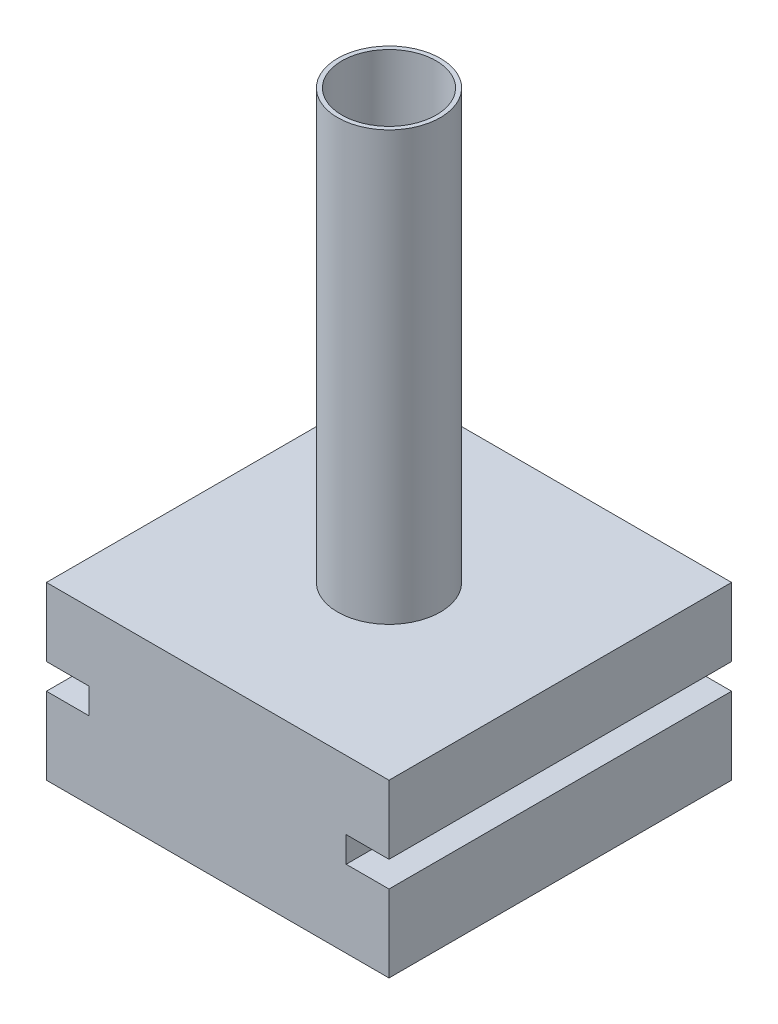
ISO-10303-21;
HEADER;
FILE_DESCRIPTION(('STEP AP214'),'2;1');
FILE_NAME('part.step','',(''),(''),'','','');
FILE_SCHEMA(('AUTOMOTIVE_DESIGN { 1 0 10303 214 1 1 1 1 }'));
ENDSEC;
DATA;
#1=APPLICATION_CONTEXT('core data for automotive mechanical design processes');
#2=APPLICATION_PROTOCOL_DEFINITION('international standard','automotive_design',2000,#1);
#3=PRODUCT_CONTEXT('',#1,'mechanical');
#4=PRODUCT('Part','Part','',(#3));
#5=PRODUCT_RELATED_PRODUCT_CATEGORY('part','',(#4));
#6=PRODUCT_DEFINITION_FORMATION('','',#4);
#7=PRODUCT_DEFINITION_CONTEXT('part definition',#1,'design');
#8=PRODUCT_DEFINITION('design','',#6,#7);
#9=PRODUCT_DEFINITION_SHAPE('','',#8);
#10=(LENGTH_UNIT() NAMED_UNIT(*) SI_UNIT(.MILLI.,.METRE.));
#11=(NAMED_UNIT(*) PLANE_ANGLE_UNIT() SI_UNIT($,.RADIAN.));
#12=(NAMED_UNIT(*) SI_UNIT($,.STERADIAN.) SOLID_ANGLE_UNIT());
#13=UNCERTAINTY_MEASURE_WITH_UNIT(LENGTH_MEASURE(1.E-05),#10,'distance_accuracy_value','');
#14=(GEOMETRIC_REPRESENTATION_CONTEXT(3) GLOBAL_UNCERTAINTY_ASSIGNED_CONTEXT((#13)) GLOBAL_UNIT_ASSIGNED_CONTEXT((#10,
#11,#12)) REPRESENTATION_CONTEXT('',''));
#15=CARTESIAN_POINT('',(0.,0.,0.));
#16=DIRECTION('',(0.,0.,1.));
#17=DIRECTION('',(1.,0.,0.));
#18=AXIS2_PLACEMENT_3D('',#15,#16,#17);
#19=CARTESIAN_POINT('',(-200.,200.,200.));
#20=DIRECTION('',(1.,0.,0.));
#21=DIRECTION('',(0.,0.,-1.));
#22=AXIS2_PLACEMENT_3D('',#19,#20,#21);
#23=PLANE('',#22);
#24=DIRECTION('',(0.,-1.,0.));
#25=VECTOR('',#24,1.);
#26=CARTESIAN_POINT('',(-200.,200.,-200.));
#27=LINE('',#26,#25);
#28=CARTESIAN_POINT('',(-200.,200.,-200.));
#29=VERTEX_POINT('',#28);
#30=CARTESIAN_POINT('',(-200.,120.,-200.));
#31=VERTEX_POINT('',#30);
#32=EDGE_CURVE('E198',#29,#31,#27,.T.);
#33=ORIENTED_EDGE('',*,*,#32,.T.);
#34=DIRECTION('',(0.,0.,-1.));
#35=VECTOR('',#34,1.);
#36=CARTESIAN_POINT('',(-200.,120.,384.));
#37=LINE('',#36,#35);
#38=CARTESIAN_POINT('',(-200.,120.,200.));
#39=VERTEX_POINT('',#38);
#40=EDGE_CURVE('E145',#39,#31,#37,.T.);
#41=ORIENTED_EDGE('',*,*,#40,.F.);
#42=DIRECTION('',(0.,-1.,0.));
#43=VECTOR('',#42,1.);
#44=CARTESIAN_POINT('',(-200.,200.,200.));
#45=LINE('',#44,#43);
#46=CARTESIAN_POINT('',(-200.,200.,200.));
#47=VERTEX_POINT('',#46);
#48=EDGE_CURVE('E25',#47,#39,#45,.T.);
#49=ORIENTED_EDGE('',*,*,#48,.F.);
#50=DIRECTION('',(0.,0.,1.));
#51=VECTOR('',#50,1.);
#52=CARTESIAN_POINT('',(-200.,200.,200.));
#53=LINE('',#52,#51);
#54=EDGE_CURVE('E177',#29,#47,#53,.T.);
#55=ORIENTED_EDGE('',*,*,#54,.F.);
#56=EDGE_LOOP('',(#33,#41,#49,#55));
#57=FACE_BOUND('',#56,.T.);
#58=ADVANCED_FACE('F17',(#57),#23,.F.);
#59=CARTESIAN_POINT('',(200.,200.,200.));
#60=DIRECTION('',(-1.,0.,0.));
#61=DIRECTION('',(0.,0.,1.));
#62=AXIS2_PLACEMENT_3D('',#59,#60,#61);
#63=PLANE('',#62);
#64=DIRECTION('',(0.,-1.,0.));
#65=VECTOR('',#64,1.);
#66=CARTESIAN_POINT('',(200.,200.,-200.));
#67=LINE('',#66,#65);
#68=CARTESIAN_POINT('',(200.,90.,-200.));
#69=VERTEX_POINT('',#68);
#70=CARTESIAN_POINT('',(200.,0.,-200.));
#71=VERTEX_POINT('',#70);
#72=EDGE_CURVE('E201',#69,#71,#67,.T.);
#73=ORIENTED_EDGE('',*,*,#72,.F.);
#74=DIRECTION('',(0.,0.,-1.));
#75=VECTOR('',#74,1.);
#76=CARTESIAN_POINT('',(200.,90.,384.));
#77=LINE('',#76,#75);
#78=CARTESIAN_POINT('',(200.,90.,200.));
#79=VERTEX_POINT('',#78);
#80=EDGE_CURVE('E134',#79,#69,#77,.T.);
#81=ORIENTED_EDGE('',*,*,#80,.F.);
#82=DIRECTION('',(0.,-1.,0.));
#83=VECTOR('',#82,1.);
#84=CARTESIAN_POINT('',(200.,200.,200.));
#85=LINE('',#84,#83);
#86=CARTESIAN_POINT('',(200.,0.,200.));
#87=VERTEX_POINT('',#86);
#88=EDGE_CURVE('E203',#79,#87,#85,.T.);
#89=ORIENTED_EDGE('',*,*,#88,.T.);
#90=DIRECTION('',(0.,0.,-1.));
#91=VECTOR('',#90,1.);
#92=CARTESIAN_POINT('',(200.,0.,200.));
#93=LINE('',#92,#91);
#94=EDGE_CURVE('E193',#87,#71,#93,.T.);
#95=ORIENTED_EDGE('',*,*,#94,.T.);
#96=EDGE_LOOP('',(#73,#81,#89,#95));
#97=FACE_BOUND('',#96,.T.);
#98=ADVANCED_FACE('F225',(#97),#63,.F.);
#99=CARTESIAN_POINT('',(-200.,90.,200.));
#100=VERTEX_POINT('',#99);
#101=CARTESIAN_POINT('',(-200.,0.,200.));
#102=VERTEX_POINT('',#101);
#103=EDGE_CURVE('E206',#100,#102,#45,.T.);
#104=ORIENTED_EDGE('',*,*,#103,.F.);
#105=DIRECTION('',(0.,0.,-1.));
#106=VECTOR('',#105,1.);
#107=CARTESIAN_POINT('',(-200.,90.,384.));
#108=LINE('',#107,#106);
#109=CARTESIAN_POINT('',(-200.,90.,-200.));
#110=VERTEX_POINT('',#109);
#111=EDGE_CURVE('E147',#100,#110,#108,.T.);
#112=ORIENTED_EDGE('',*,*,#111,.T.);
#113=CARTESIAN_POINT('',(-200.,0.,-200.));
#114=VERTEX_POINT('',#113);
#115=EDGE_CURVE('E187',#110,#114,#27,.T.);
#116=ORIENTED_EDGE('',*,*,#115,.T.);
#117=DIRECTION('',(0.,0.,1.));
#118=VECTOR('',#117,1.);
#119=CARTESIAN_POINT('',(-200.,0.,200.));
#120=LINE('',#119,#118);
#121=EDGE_CURVE('E174',#114,#102,#120,.T.);
#122=ORIENTED_EDGE('',*,*,#121,.T.);
#123=EDGE_LOOP('',(#104,#112,#116,#122));
#124=FACE_BOUND('',#123,.T.);
#125=ADVANCED_FACE('F19',(#124),#23,.F.);
#126=CARTESIAN_POINT('',(200.,200.,200.));
#127=DIRECTION('',(0.,0.,-1.));
#128=DIRECTION('',(-1.,0.,0.));
#129=AXIS2_PLACEMENT_3D('',#126,#127,#128);
#130=PLANE('',#129);
#131=ORIENTED_EDGE('',*,*,#88,.F.);
#132=DIRECTION('',(-1.,0.,0.));
#133=VECTOR('',#132,1.);
#134=CARTESIAN_POINT('',(200.,90.,200.));
#135=LINE('',#134,#133);
#136=CARTESIAN_POINT('',(150.,90.,200.));
#137=VERTEX_POINT('',#136);
#138=EDGE_CURVE('E164',#79,#137,#135,.T.);
#139=ORIENTED_EDGE('',*,*,#138,.T.);
#140=DIRECTION('',(0.,1.,0.));
#141=VECTOR('',#140,1.);
#142=CARTESIAN_POINT('',(150.,200.,200.));
#143=LINE('',#142,#141);
#144=CARTESIAN_POINT('',(150.,120.,200.));
#145=VERTEX_POINT('',#144);
#146=EDGE_CURVE('E161',#137,#145,#143,.T.);
#147=ORIENTED_EDGE('',*,*,#146,.T.);
#148=DIRECTION('',(1.,0.,0.));
#149=VECTOR('',#148,1.);
#150=CARTESIAN_POINT('',(200.,120.,200.));
#151=LINE('',#150,#149);
#152=CARTESIAN_POINT('',(200.,120.,200.));
#153=VERTEX_POINT('',#152);
#154=EDGE_CURVE('E114',#145,#153,#151,.T.);
#155=ORIENTED_EDGE('',*,*,#154,.T.);
#156=CARTESIAN_POINT('',(200.,200.,200.));
#157=VERTEX_POINT('',#156);
#158=EDGE_CURVE('E204',#157,#153,#85,.T.);
#159=ORIENTED_EDGE('',*,*,#158,.F.);
#160=DIRECTION('',(1.,0.,0.));
#161=VECTOR('',#160,1.);
#162=CARTESIAN_POINT('',(200.,200.,200.));
#163=LINE('',#162,#161);
#164=EDGE_CURVE('E180',#47,#157,#163,.T.);
#165=ORIENTED_EDGE('',*,*,#164,.F.);
#166=ORIENTED_EDGE('',*,*,#48,.T.);
#167=DIRECTION('',(1.,0.,0.));
#168=VECTOR('',#167,1.);
#169=CARTESIAN_POINT('',(200.,120.,200.));
#170=LINE('',#169,#168);
#171=CARTESIAN_POINT('',(-150.,120.,200.));
#172=VERTEX_POINT('',#171);
#173=EDGE_CURVE('E158',#39,#172,#170,.T.);
#174=ORIENTED_EDGE('',*,*,#173,.T.);
#175=DIRECTION('',(0.,-1.,0.));
#176=VECTOR('',#175,1.);
#177=CARTESIAN_POINT('',(-150.,200.,200.));
#178=LINE('',#177,#176);
#179=CARTESIAN_POINT('',(-150.,90.,200.));
#180=VERTEX_POINT('',#179);
#181=EDGE_CURVE('E136',#172,#180,#178,.T.);
#182=ORIENTED_EDGE('',*,*,#181,.T.);
#183=DIRECTION('',(-1.,0.,0.));
#184=VECTOR('',#183,1.);
#185=CARTESIAN_POINT('',(200.,90.,200.));
#186=LINE('',#185,#184);
#187=EDGE_CURVE('E155',#180,#100,#186,.T.);
#188=ORIENTED_EDGE('',*,*,#187,.T.);
#189=ORIENTED_EDGE('',*,*,#103,.T.);
#190=DIRECTION('',(1.,0.,0.));
#191=VECTOR('',#190,1.);
#192=CARTESIAN_POINT('',(200.,0.,200.));
#193=LINE('',#192,#191);
#194=EDGE_CURVE('E190',#102,#87,#193,.T.);
#195=ORIENTED_EDGE('',*,*,#194,.T.);
#196=EDGE_LOOP('',(#131,#139,#147,#155,#159,#165,#166,#174,#182,#188,#189,#195));
#197=FACE_BOUND('',#196,.T.);
#198=ADVANCED_FACE('F213',(#197),#130,.F.);
#199=ORIENTED_EDGE('',*,*,#158,.T.);
#200=DIRECTION('',(0.,0.,-1.));
#201=VECTOR('',#200,1.);
#202=CARTESIAN_POINT('',(200.,120.,384.));
#203=LINE('',#202,#201);
#204=CARTESIAN_POINT('',(200.,120.,-200.));
#205=VERTEX_POINT('',#204);
#206=EDGE_CURVE('E117',#153,#205,#203,.T.);
#207=ORIENTED_EDGE('',*,*,#206,.T.);
#208=CARTESIAN_POINT('',(200.,200.,-200.));
#209=VERTEX_POINT('',#208);
#210=EDGE_CURVE('E129',#209,#205,#67,.T.);
#211=ORIENTED_EDGE('',*,*,#210,.F.);
#212=DIRECTION('',(0.,0.,-1.));
#213=VECTOR('',#212,1.);
#214=CARTESIAN_POINT('',(200.,200.,200.));
#215=LINE('',#214,#213);
#216=EDGE_CURVE('E183',#157,#209,#215,.T.);
#217=ORIENTED_EDGE('',*,*,#216,.F.);
#218=EDGE_LOOP('',(#199,#207,#211,#217));
#219=FACE_BOUND('',#218,.T.);
#220=ADVANCED_FACE('F249',(#219),#63,.F.);
#221=CARTESIAN_POINT('',(200.,200.,-200.));
#222=DIRECTION('',(0.,0.,1.));
#223=DIRECTION('',(1.,0.,0.));
#224=AXIS2_PLACEMENT_3D('',#221,#222,#223);
#225=PLANE('',#224);
#226=DIRECTION('',(0.,1.,0.));
#227=VECTOR('',#226,1.);
#228=CARTESIAN_POINT('',(150.,90.,-200.));
#229=LINE('',#228,#227);
#230=CARTESIAN_POINT('',(150.,90.,-200.));
#231=VERTEX_POINT('',#230);
#232=CARTESIAN_POINT('',(150.,120.,-200.));
#233=VERTEX_POINT('',#232);
#234=EDGE_CURVE('E121',#231,#233,#229,.T.);
#235=ORIENTED_EDGE('',*,*,#234,.F.);
#236=DIRECTION('',(-1.,0.,0.));
#237=VECTOR('',#236,1.);
#238=CARTESIAN_POINT('',(200.,90.,-200.));
#239=LINE('',#238,#237);
#240=EDGE_CURVE('E32',#69,#231,#239,.T.);
#241=ORIENTED_EDGE('',*,*,#240,.F.);
#242=ORIENTED_EDGE('',*,*,#72,.T.);
#243=DIRECTION('',(-1.,0.,0.));
#244=VECTOR('',#243,1.);
#245=CARTESIAN_POINT('',(200.,0.,-200.));
#246=LINE('',#245,#244);
#247=EDGE_CURVE('E181',#71,#114,#246,.T.);
#248=ORIENTED_EDGE('',*,*,#247,.T.);
#249=ORIENTED_EDGE('',*,*,#115,.F.);
#250=DIRECTION('',(-1.,0.,0.));
#251=VECTOR('',#250,1.);
#252=CARTESIAN_POINT('',(-200.,90.,-200.));
#253=LINE('',#252,#251);
#254=CARTESIAN_POINT('',(-150.,90.,-200.));
#255=VERTEX_POINT('',#254);
#256=EDGE_CURVE('E142',#255,#110,#253,.T.);
#257=ORIENTED_EDGE('',*,*,#256,.F.);
#258=DIRECTION('',(0.,-1.,0.));
#259=VECTOR('',#258,1.);
#260=CARTESIAN_POINT('',(-150.,90.,-200.));
#261=LINE('',#260,#259);
#262=CARTESIAN_POINT('',(-150.,120.,-200.));
#263=VERTEX_POINT('',#262);
#264=EDGE_CURVE('E139',#263,#255,#261,.T.);
#265=ORIENTED_EDGE('',*,*,#264,.F.);
#266=DIRECTION('',(1.,0.,0.));
#267=VECTOR('',#266,1.);
#268=CARTESIAN_POINT('',(-150.,120.,-200.));
#269=LINE('',#268,#267);
#270=EDGE_CURVE('E40',#31,#263,#269,.T.);
#271=ORIENTED_EDGE('',*,*,#270,.F.);
#272=ORIENTED_EDGE('',*,*,#32,.F.);
#273=DIRECTION('',(-1.,0.,0.));
#274=VECTOR('',#273,1.);
#275=CARTESIAN_POINT('',(200.,200.,-200.));
#276=LINE('',#275,#274);
#277=EDGE_CURVE('E185',#209,#29,#276,.T.);
#278=ORIENTED_EDGE('',*,*,#277,.F.);
#279=ORIENTED_EDGE('',*,*,#210,.T.);
#280=DIRECTION('',(1.,0.,0.));
#281=VECTOR('',#280,1.);
#282=CARTESIAN_POINT('',(150.,120.,-200.));
#283=LINE('',#282,#281);
#284=EDGE_CURVE('E111',#233,#205,#283,.T.);
#285=ORIENTED_EDGE('',*,*,#284,.F.);
#286=EDGE_LOOP('',(#235,#241,#242,#248,#249,#257,#265,#271,#272,#278,#279,#285));
#287=FACE_BOUND('',#286,.T.);
#288=ADVANCED_FACE('F126',(#287),#225,.F.);
#289=CARTESIAN_POINT('',(0.,200.,0.));
#290=DIRECTION('',(0.,1.,0.));
#291=DIRECTION('',(0.,0.,1.));
#292=AXIS2_PLACEMENT_3D('',#289,#290,#291);
#293=PLANE('',#292);
#294=CARTESIAN_POINT('',(0.,200.,0.));
#295=DIRECTION('',(0.,1.,0.));
#296=DIRECTION('',(0.,0.,1.));
#297=AXIS2_PLACEMENT_3D('',#294,#295,#296);
#298=CIRCLE('',#297,60.);
#299=CARTESIAN_POINT('',(0.,200.,60.));
#300=VERTEX_POINT('',#299);
#301=EDGE_CURVE('E170',#300,#300,#298,.T.);
#302=ORIENTED_EDGE('',*,*,#301,.F.);
#303=EDGE_LOOP('',(#302));
#304=FACE_BOUND('',#303,.T.);
#305=ORIENTED_EDGE('',*,*,#54,.T.);
#306=ORIENTED_EDGE('',*,*,#164,.T.);
#307=ORIENTED_EDGE('',*,*,#216,.T.);
#308=ORIENTED_EDGE('',*,*,#277,.T.);
#309=EDGE_LOOP('',(#305,#306,#307,#308));
#310=FACE_BOUND('',#309,.T.);
#311=ADVANCED_FACE('F263',(#304,#310),#293,.T.);
#312=CARTESIAN_POINT('',(0.,0.,0.));
#313=DIRECTION('',(0.,1.,0.));
#314=DIRECTION('',(0.,0.,1.));
#315=AXIS2_PLACEMENT_3D('',#312,#313,#314);
#316=PLANE('',#315);
#317=ORIENTED_EDGE('',*,*,#121,.F.);
#318=ORIENTED_EDGE('',*,*,#247,.F.);
#319=ORIENTED_EDGE('',*,*,#94,.F.);
#320=ORIENTED_EDGE('',*,*,#194,.F.);
#321=EDGE_LOOP('',(#317,#318,#319,#320));
#322=FACE_BOUND('',#321,.T.);
#323=ADVANCED_FACE('F218',(#322),#316,.F.);
#324=CARTESIAN_POINT('',(0.,700.,0.));
#325=DIRECTION('',(0.,1.,0.));
#326=DIRECTION('',(0.,0.,1.));
#327=AXIS2_PLACEMENT_3D('',#324,#325,#326);
#328=PLANE('',#327);
#329=CARTESIAN_POINT('',(0.,700.,0.));
#330=DIRECTION('',(0.,1.,0.));
#331=DIRECTION('',(0.,0.,1.));
#332=AXIS2_PLACEMENT_3D('',#329,#330,#331);
#333=CIRCLE('',#332,60.);
#334=CARTESIAN_POINT('',(0.,700.,60.));
#335=VERTEX_POINT('',#334);
#336=EDGE_CURVE('E171',#335,#335,#333,.T.);
#337=ORIENTED_EDGE('',*,*,#336,.T.);
#338=EDGE_LOOP('',(#337));
#339=FACE_BOUND('',#338,.T.);
#340=CARTESIAN_POINT('',(0.,700.,0.));
#341=DIRECTION('',(0.,1.,0.));
#342=DIRECTION('',(0.,0.,1.));
#343=AXIS2_PLACEMENT_3D('',#340,#341,#342);
#344=CIRCLE('',#343,55.);
#345=CARTESIAN_POINT('',(0.,700.,55.));
#346=VERTEX_POINT('',#345);
#347=EDGE_CURVE('E167',#346,#346,#344,.T.);
#348=ORIENTED_EDGE('',*,*,#347,.F.);
#349=EDGE_LOOP('',(#348));
#350=FACE_BOUND('',#349,.T.);
#351=ADVANCED_FACE('F266',(#339,#350),#328,.T.);
#352=CARTESIAN_POINT('',(0.,700.,0.));
#353=DIRECTION('',(0.,-1.,0.));
#354=DIRECTION('',(0.,0.,-1.));
#355=AXIS2_PLACEMENT_3D('',#352,#353,#354);
#356=CYLINDRICAL_SURFACE('',#355,60.);
#357=ORIENTED_EDGE('',*,*,#336,.F.);
#358=EDGE_LOOP('',(#357));
#359=FACE_BOUND('',#358,.T.);
#360=ORIENTED_EDGE('',*,*,#301,.T.);
#361=EDGE_LOOP('',(#360));
#362=FACE_BOUND('',#361,.T.);
#363=ADVANCED_FACE('F271',(#359,#362),#356,.T.);
#364=CARTESIAN_POINT('',(0.,700.,0.));
#365=DIRECTION('',(0.,-1.,0.));
#366=DIRECTION('',(0.,0.,-1.));
#367=AXIS2_PLACEMENT_3D('',#364,#365,#366);
#368=CYLINDRICAL_SURFACE('',#367,55.);
#369=ORIENTED_EDGE('',*,*,#347,.T.);
#370=EDGE_LOOP('',(#369));
#371=FACE_BOUND('',#370,.T.);
#372=CARTESIAN_POINT('',(0.,200.,0.));
#373=DIRECTION('',(0.,1.,0.));
#374=DIRECTION('',(0.,0.,1.));
#375=AXIS2_PLACEMENT_3D('',#372,#373,#374);
#376=CIRCLE('',#375,55.);
#377=CARTESIAN_POINT('',(0.,200.,55.));
#378=VERTEX_POINT('',#377);
#379=EDGE_CURVE('E11',#378,#378,#376,.F.);
#380=ORIENTED_EDGE('',*,*,#379,.T.);
#381=EDGE_LOOP('',(#380));
#382=FACE_BOUND('',#381,.T.);
#383=ADVANCED_FACE('F274',(#371,#382),#368,.F.);
#384=ORIENTED_EDGE('',*,*,#379,.F.);
#385=EDGE_LOOP('',(#384));
#386=FACE_BOUND('',#385,.T.);
#387=ADVANCED_FACE('F270',(#386),#293,.T.);
#388=CARTESIAN_POINT('',(-150.,120.,384.));
#389=DIRECTION('',(0.,1.,0.));
#390=DIRECTION('',(-1.,0.,0.));
#391=AXIS2_PLACEMENT_3D('',#388,#389,#390);
#392=PLANE('',#391);
#393=ORIENTED_EDGE('',*,*,#40,.T.);
#394=ORIENTED_EDGE('',*,*,#270,.T.);
#395=DIRECTION('',(0.,0.,-1.));
#396=VECTOR('',#395,1.);
#397=CARTESIAN_POINT('',(-150.,120.,384.));
#398=LINE('',#397,#396);
#399=EDGE_CURVE('E144',#172,#263,#398,.T.);
#400=ORIENTED_EDGE('',*,*,#399,.F.);
#401=ORIENTED_EDGE('',*,*,#173,.F.);
#402=EDGE_LOOP('',(#393,#394,#400,#401));
#403=FACE_BOUND('',#402,.T.);
#404=ADVANCED_FACE('F282',(#403),#392,.F.);
#405=CARTESIAN_POINT('',(-200.,90.,384.));
#406=DIRECTION('',(0.,-1.,0.));
#407=DIRECTION('',(1.,0.,0.));
#408=AXIS2_PLACEMENT_3D('',#405,#406,#407);
#409=PLANE('',#408);
#410=DIRECTION('',(0.,0.,-1.));
#411=VECTOR('',#410,1.);
#412=CARTESIAN_POINT('',(-150.,90.,384.));
#413=LINE('',#412,#411);
#414=EDGE_CURVE('E150',#180,#255,#413,.T.);
#415=ORIENTED_EDGE('',*,*,#414,.T.);
#416=ORIENTED_EDGE('',*,*,#256,.T.);
#417=ORIENTED_EDGE('',*,*,#111,.F.);
#418=ORIENTED_EDGE('',*,*,#187,.F.);
#419=EDGE_LOOP('',(#415,#416,#417,#418));
#420=FACE_BOUND('',#419,.T.);
#421=ADVANCED_FACE('F237',(#420),#409,.F.);
#422=CARTESIAN_POINT('',(-150.,90.,384.));
#423=DIRECTION('',(1.,0.,0.));
#424=DIRECTION('',(0.,0.,-1.));
#425=AXIS2_PLACEMENT_3D('',#422,#423,#424);
#426=PLANE('',#425);
#427=ORIENTED_EDGE('',*,*,#399,.T.);
#428=ORIENTED_EDGE('',*,*,#264,.T.);
#429=ORIENTED_EDGE('',*,*,#414,.F.);
#430=ORIENTED_EDGE('',*,*,#181,.F.);
#431=EDGE_LOOP('',(#427,#428,#429,#430));
#432=FACE_BOUND('',#431,.T.);
#433=ADVANCED_FACE('F228',(#432),#426,.F.);
#434=CARTESIAN_POINT('',(200.,90.,384.));
#435=DIRECTION('',(0.,-1.,0.));
#436=DIRECTION('',(0.,0.,-1.));
#437=AXIS2_PLACEMENT_3D('',#434,#435,#436);
#438=PLANE('',#437);
#439=ORIENTED_EDGE('',*,*,#80,.T.);
#440=ORIENTED_EDGE('',*,*,#240,.T.);
#441=DIRECTION('',(0.,0.,-1.));
#442=VECTOR('',#441,1.);
#443=CARTESIAN_POINT('',(150.,90.,384.));
#444=LINE('',#443,#442);
#445=EDGE_CURVE('E118',#137,#231,#444,.T.);
#446=ORIENTED_EDGE('',*,*,#445,.F.);
#447=ORIENTED_EDGE('',*,*,#138,.F.);
#448=EDGE_LOOP('',(#439,#440,#446,#447));
#449=FACE_BOUND('',#448,.T.);
#450=ADVANCED_FACE('F226',(#449),#438,.F.);
#451=CARTESIAN_POINT('',(150.,120.,384.));
#452=DIRECTION('',(0.,1.,0.));
#453=DIRECTION('',(0.,0.,1.));
#454=AXIS2_PLACEMENT_3D('',#451,#452,#453);
#455=PLANE('',#454);
#456=DIRECTION('',(0.,0.,-1.));
#457=VECTOR('',#456,1.);
#458=CARTESIAN_POINT('',(150.,120.,384.));
#459=LINE('',#458,#457);
#460=EDGE_CURVE('E107',#145,#233,#459,.T.);
#461=ORIENTED_EDGE('',*,*,#460,.T.);
#462=ORIENTED_EDGE('',*,*,#284,.T.);
#463=ORIENTED_EDGE('',*,*,#206,.F.);
#464=ORIENTED_EDGE('',*,*,#154,.F.);
#465=EDGE_LOOP('',(#461,#462,#463,#464));
#466=FACE_BOUND('',#465,.T.);
#467=ADVANCED_FACE('F109',(#466),#455,.F.);
#468=CARTESIAN_POINT('',(150.,90.,384.));
#469=DIRECTION('',(-1.,0.,0.));
#470=DIRECTION('',(0.,0.,1.));
#471=AXIS2_PLACEMENT_3D('',#468,#469,#470);
#472=PLANE('',#471);
#473=ORIENTED_EDGE('',*,*,#445,.T.);
#474=ORIENTED_EDGE('',*,*,#234,.T.);
#475=ORIENTED_EDGE('',*,*,#460,.F.);
#476=ORIENTED_EDGE('',*,*,#146,.F.);
#477=EDGE_LOOP('',(#473,#474,#475,#476));
#478=FACE_BOUND('',#477,.T.);
#479=ADVANCED_FACE('F122',(#478),#472,.F.);
#480=CLOSED_SHELL('',(#58,#98,#125,#198,#220,#288,#311,#323,#351,#363,#383,#387,#404,#421,#433,
#450,#467,#479));
#481=MANIFOLD_SOLID_BREP('B1',#480);
#482=ADVANCED_BREP_SHAPE_REPRESENTATION('',(#18,#481),#14);
#483=SHAPE_DEFINITION_REPRESENTATION(#9,#482);
ENDSEC;
END-ISO-10303-21;
